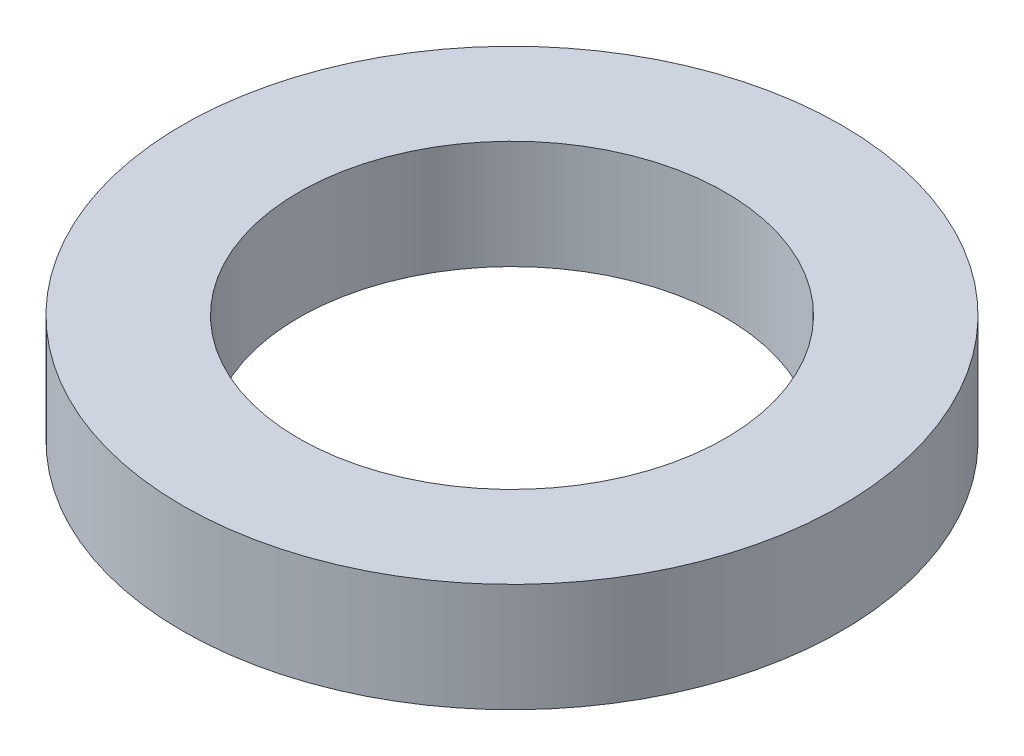
ISO-10303-21;
HEADER;
FILE_DESCRIPTION(('STEP AP214'),'2;1');
FILE_NAME('part.step','',(''),(''),'','','');
FILE_SCHEMA(('AUTOMOTIVE_DESIGN { 1 0 10303 214 1 1 1 1 }'));
ENDSEC;
DATA;
#1=APPLICATION_CONTEXT('core data for automotive mechanical design processes');
#2=APPLICATION_PROTOCOL_DEFINITION('international standard','automotive_design',2000,#1);
#3=PRODUCT_CONTEXT('',#1,'mechanical');
#4=PRODUCT('Part','Part','',(#3));
#5=PRODUCT_RELATED_PRODUCT_CATEGORY('part','',(#4));
#6=PRODUCT_DEFINITION_FORMATION('','',#4);
#7=PRODUCT_DEFINITION_CONTEXT('part definition',#1,'design');
#8=PRODUCT_DEFINITION('design','',#6,#7);
#9=PRODUCT_DEFINITION_SHAPE('','',#8);
#10=(LENGTH_UNIT() NAMED_UNIT(*) SI_UNIT(.MILLI.,.METRE.));
#11=(NAMED_UNIT(*) PLANE_ANGLE_UNIT() SI_UNIT($,.RADIAN.));
#12=(NAMED_UNIT(*) SI_UNIT($,.STERADIAN.) SOLID_ANGLE_UNIT());
#13=UNCERTAINTY_MEASURE_WITH_UNIT(LENGTH_MEASURE(1.E-05),#10,'distance_accuracy_value','');
#14=(GEOMETRIC_REPRESENTATION_CONTEXT(3) GLOBAL_UNCERTAINTY_ASSIGNED_CONTEXT((#13)) GLOBAL_UNIT_ASSIGNED_CONTEXT((#10,
#11,#12)) REPRESENTATION_CONTEXT('',''));
#15=CARTESIAN_POINT('',(0.,0.,0.));
#16=DIRECTION('',(0.,0.,1.));
#17=DIRECTION('',(1.,0.,0.));
#18=AXIS2_PLACEMENT_3D('',#15,#16,#17);
#19=CARTESIAN_POINT('',(0.,14.,0.));
#20=DIRECTION('',(0.,-1.,0.));
#21=DIRECTION('',(0.,0.,-1.));
#22=AXIS2_PLACEMENT_3D('',#19,#20,#21);
#23=CYLINDRICAL_SURFACE('',#22,42.5);
#24=CARTESIAN_POINT('',(0.,14.,0.));
#25=DIRECTION('',(0.,1.,0.));
#26=DIRECTION('',(0.,0.,1.));
#27=AXIS2_PLACEMENT_3D('',#24,#25,#26);
#28=CIRCLE('',#27,42.5);
#29=CARTESIAN_POINT('',(0.,14.,42.5));
#30=VERTEX_POINT('',#29);
#31=EDGE_CURVE('E10',#30,#30,#28,.T.);
#32=ORIENTED_EDGE('',*,*,#31,.F.);
#33=EDGE_LOOP('',(#32));
#34=FACE_BOUND('',#33,.T.);
#35=CARTESIAN_POINT('',(0.,0.,0.));
#36=DIRECTION('',(0.,1.,0.));
#37=DIRECTION('',(0.,0.,1.));
#38=AXIS2_PLACEMENT_3D('',#35,#36,#37);
#39=CIRCLE('',#38,42.5);
#40=CARTESIAN_POINT('',(0.,0.,42.5));
#41=VERTEX_POINT('',#40);
#42=EDGE_CURVE('E37',#41,#41,#39,.T.);
#43=ORIENTED_EDGE('',*,*,#42,.T.);
#44=EDGE_LOOP('',(#43));
#45=FACE_BOUND('',#44,.T.);
#46=ADVANCED_FACE('F40',(#34,#45),#23,.T.);
#47=CARTESIAN_POINT('',(0.,14.,0.));
#48=DIRECTION('',(0.,1.,0.));
#49=DIRECTION('',(0.,0.,1.));
#50=AXIS2_PLACEMENT_3D('',#47,#48,#49);
#51=PLANE('',#50);
#52=CARTESIAN_POINT('',(0.,14.,0.));
#53=DIRECTION('',(0.,1.,0.));
#54=DIRECTION('',(0.,0.,1.));
#55=AXIS2_PLACEMENT_3D('',#52,#53,#54);
#56=CIRCLE('',#55,27.5);
#57=CARTESIAN_POINT('',(0.,14.,27.5));
#58=VERTEX_POINT('',#57);
#59=EDGE_CURVE('E50',#58,#58,#56,.T.);
#60=ORIENTED_EDGE('',*,*,#59,.F.);
#61=EDGE_LOOP('',(#60));
#62=FACE_BOUND('',#61,.T.);
#63=ORIENTED_EDGE('',*,*,#31,.T.);
#64=EDGE_LOOP('',(#63));
#65=FACE_BOUND('',#64,.T.);
#66=ADVANCED_FACE('F59',(#62,#65),#51,.T.);
#67=CARTESIAN_POINT('',(0.,0.,0.));
#68=DIRECTION('',(0.,1.,0.));
#69=DIRECTION('',(0.,0.,1.));
#70=AXIS2_PLACEMENT_3D('',#67,#68,#69);
#71=PLANE('',#70);
#72=CARTESIAN_POINT('',(0.,0.,0.));
#73=DIRECTION('',(0.,1.,0.));
#74=DIRECTION('',(0.,0.,1.));
#75=AXIS2_PLACEMENT_3D('',#72,#73,#74);
#76=CIRCLE('',#75,27.5);
#77=CARTESIAN_POINT('',(0.,0.,27.5));
#78=VERTEX_POINT('',#77);
#79=EDGE_CURVE('E47',#78,#78,#76,.T.);
#80=ORIENTED_EDGE('',*,*,#79,.T.);
#81=EDGE_LOOP('',(#80));
#82=FACE_BOUND('',#81,.T.);
#83=ORIENTED_EDGE('',*,*,#42,.F.);
#84=EDGE_LOOP('',(#83));
#85=FACE_BOUND('',#84,.T.);
#86=ADVANCED_FACE('F58',(#82,#85),#71,.F.);
#87=CARTESIAN_POINT('',(0.,14.,0.));
#88=DIRECTION('',(0.,-1.,0.));
#89=DIRECTION('',(0.,0.,-1.));
#90=AXIS2_PLACEMENT_3D('',#87,#88,#89);
#91=CYLINDRICAL_SURFACE('',#90,27.5);
#92=ORIENTED_EDGE('',*,*,#59,.T.);
#93=EDGE_LOOP('',(#92));
#94=FACE_BOUND('',#93,.T.);
#95=ORIENTED_EDGE('',*,*,#79,.F.);
#96=EDGE_LOOP('',(#95));
#97=FACE_BOUND('',#96,.T.);
#98=ADVANCED_FACE('F54',(#94,#97),#91,.F.);
#99=CLOSED_SHELL('',(#46,#66,#86,#98));
#100=MANIFOLD_SOLID_BREP('B2',#99);
#101=ADVANCED_BREP_SHAPE_REPRESENTATION('',(#18,#100),#14);
#102=SHAPE_DEFINITION_REPRESENTATION(#9,#101);
ENDSEC;
END-ISO-10303-21;
